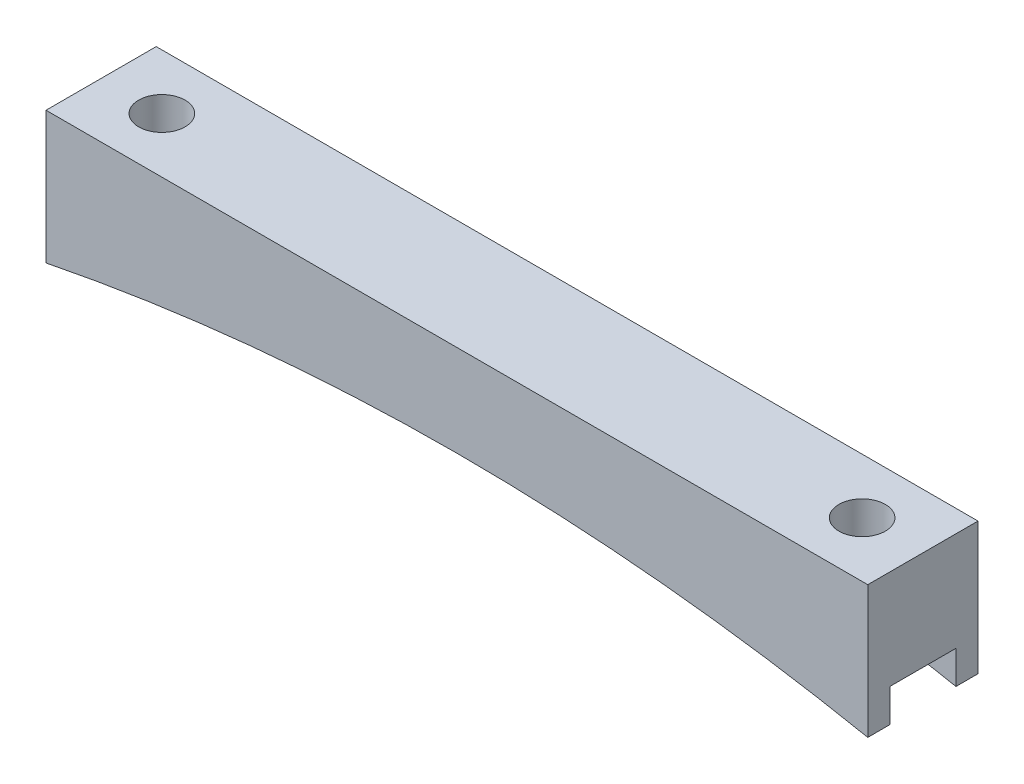
ISO-10303-21;
HEADER;
FILE_DESCRIPTION(('STEP AP214'),'2;1');
FILE_NAME('part.step','',(''),(''),'','','');
FILE_SCHEMA(('AUTOMOTIVE_DESIGN { 1 0 10303 214 1 1 1 1 }'));
ENDSEC;
DATA;
#1=APPLICATION_CONTEXT('core data for automotive mechanical design processes');
#2=APPLICATION_PROTOCOL_DEFINITION('international standard','automotive_design',2000,#1);
#3=PRODUCT_CONTEXT('',#1,'mechanical');
#4=PRODUCT('Part','Part','',(#3));
#5=PRODUCT_RELATED_PRODUCT_CATEGORY('part','',(#4));
#6=PRODUCT_DEFINITION_FORMATION('','',#4);
#7=PRODUCT_DEFINITION_CONTEXT('part definition',#1,'design');
#8=PRODUCT_DEFINITION('design','',#6,#7);
#9=PRODUCT_DEFINITION_SHAPE('','',#8);
#10=(LENGTH_UNIT() NAMED_UNIT(*) SI_UNIT(.MILLI.,.METRE.));
#11=(NAMED_UNIT(*) PLANE_ANGLE_UNIT() SI_UNIT($,.RADIAN.));
#12=(NAMED_UNIT(*) SI_UNIT($,.STERADIAN.) SOLID_ANGLE_UNIT());
#13=UNCERTAINTY_MEASURE_WITH_UNIT(LENGTH_MEASURE(1.E-05),#10,'distance_accuracy_value','');
#14=(GEOMETRIC_REPRESENTATION_CONTEXT(3) GLOBAL_UNCERTAINTY_ASSIGNED_CONTEXT((#13)) GLOBAL_UNIT_ASSIGNED_CONTEXT((#10,
#11,#12)) REPRESENTATION_CONTEXT('',''));
#15=CARTESIAN_POINT('',(0.,0.,0.));
#16=DIRECTION('',(0.,0.,1.));
#17=DIRECTION('',(1.,0.,0.));
#18=AXIS2_PLACEMENT_3D('',#15,#16,#17);
#19=CARTESIAN_POINT('',(47.34,0.,12.7));
#20=DIRECTION('',(-1.,0.,0.));
#21=DIRECTION('',(0.,-1.,0.));
#22=AXIS2_PLACEMENT_3D('',#19,#20,#21);
#23=PLANE('',#22);
#24=DIRECTION('',(0.,0.,-1.));
#25=VECTOR('',#24,1.);
#26=CARTESIAN_POINT('',(47.34,-15.24,12.7));
#27=LINE('',#26,#25);
#28=CARTESIAN_POINT('',(47.34,-15.24,12.7));
#29=VERTEX_POINT('',#28);
#30=CARTESIAN_POINT('',(47.34,-15.24,10.16));
#31=VERTEX_POINT('',#30);
#32=EDGE_CURVE('E156',#29,#31,#27,.T.);
#33=ORIENTED_EDGE('',*,*,#32,.T.);
#34=DIRECTION('',(0.,-1.,0.));
#35=VECTOR('',#34,1.);
#36=CARTESIAN_POINT('',(47.34,-15.24,10.16));
#37=LINE('',#36,#35);
#38=CARTESIAN_POINT('',(47.34,-11.43,10.16));
#39=VERTEX_POINT('',#38);
#40=EDGE_CURVE('E185',#39,#31,#37,.T.);
#41=ORIENTED_EDGE('',*,*,#40,.F.);
#42=DIRECTION('',(0.,0.,1.));
#43=VECTOR('',#42,1.);
#44=CARTESIAN_POINT('',(47.34,-11.43,10.16));
#45=LINE('',#44,#43);
#46=CARTESIAN_POINT('',(47.34,-11.43,2.54));
#47=VERTEX_POINT('',#46);
#48=EDGE_CURVE('E141',#47,#39,#45,.T.);
#49=ORIENTED_EDGE('',*,*,#48,.F.);
#50=DIRECTION('',(0.,1.,0.));
#51=VECTOR('',#50,1.);
#52=CARTESIAN_POINT('',(47.34,-15.24,2.54));
#53=LINE('',#52,#51);
#54=CARTESIAN_POINT('',(47.34,-15.24,2.54));
#55=VERTEX_POINT('',#54);
#56=EDGE_CURVE('E177',#55,#47,#53,.T.);
#57=ORIENTED_EDGE('',*,*,#56,.F.);
#58=CARTESIAN_POINT('',(47.34,-15.24,0.));
#59=VERTEX_POINT('',#58);
#60=EDGE_CURVE('E174',#55,#59,#27,.T.);
#61=ORIENTED_EDGE('',*,*,#60,.T.);
#62=DIRECTION('',(0.,1.,0.));
#63=VECTOR('',#62,1.);
#64=CARTESIAN_POINT('',(47.34,0.,0.));
#65=LINE('',#64,#63);
#66=CARTESIAN_POINT('',(47.34,0.,0.));
#67=VERTEX_POINT('',#66);
#68=EDGE_CURVE('E213',#59,#67,#65,.T.);
#69=ORIENTED_EDGE('',*,*,#68,.T.);
#70=DIRECTION('',(0.,0.,-1.));
#71=VECTOR('',#70,1.);
#72=CARTESIAN_POINT('',(47.34,0.,12.7));
#73=LINE('',#72,#71);
#74=CARTESIAN_POINT('',(47.34,0.,12.7));
#75=VERTEX_POINT('',#74);
#76=EDGE_CURVE('E154',#75,#67,#73,.T.);
#77=ORIENTED_EDGE('',*,*,#76,.F.);
#78=DIRECTION('',(0.,1.,0.));
#79=VECTOR('',#78,1.);
#80=CARTESIAN_POINT('',(47.34,0.,12.7));
#81=LINE('',#80,#79);
#82=EDGE_CURVE('E217',#29,#75,#81,.T.);
#83=ORIENTED_EDGE('',*,*,#82,.F.);
#84=EDGE_LOOP('',(#33,#41,#49,#57,#61,#69,#77,#83));
#85=FACE_BOUND('',#84,.T.);
#86=ADVANCED_FACE('F43',(#85),#23,.F.);
#87=CARTESIAN_POINT('',(-47.34,0.,12.7));
#88=DIRECTION('',(0.,-1.,0.));
#89=DIRECTION('',(1.,0.,0.));
#90=AXIS2_PLACEMENT_3D('',#87,#88,#89);
#91=PLANE('',#90);
#92=CARTESIAN_POINT('',(-40.34,0.,6.35));
#93=DIRECTION('',(0.,1.,0.));
#94=DIRECTION('',(-1.,0.,0.));
#95=AXIS2_PLACEMENT_3D('',#92,#93,#94);
#96=CIRCLE('',#95,2.675);
#97=CARTESIAN_POINT('',(-43.015,0.,6.35));
#98=VERTEX_POINT('',#97);
#99=EDGE_CURVE('E209',#98,#98,#96,.T.);
#100=ORIENTED_EDGE('',*,*,#99,.F.);
#101=EDGE_LOOP('',(#100));
#102=FACE_BOUND('',#101,.T.);
#103=CARTESIAN_POINT('',(40.34,0.,6.35));
#104=DIRECTION('',(0.,1.,0.));
#105=DIRECTION('',(-1.,0.,0.));
#106=AXIS2_PLACEMENT_3D('',#103,#104,#105);
#107=CIRCLE('',#106,2.675);
#108=CARTESIAN_POINT('',(37.665,0.,6.35));
#109=VERTEX_POINT('',#108);
#110=EDGE_CURVE('E208',#109,#109,#107,.T.);
#111=ORIENTED_EDGE('',*,*,#110,.F.);
#112=EDGE_LOOP('',(#111));
#113=FACE_BOUND('',#112,.T.);
#114=DIRECTION('',(-1.,0.,0.));
#115=VECTOR('',#114,1.);
#116=CARTESIAN_POINT('',(-47.34,0.,0.));
#117=LINE('',#116,#115);
#118=CARTESIAN_POINT('',(-47.34,0.,0.));
#119=VERTEX_POINT('',#118);
#120=EDGE_CURVE('E232',#67,#119,#117,.T.);
#121=ORIENTED_EDGE('',*,*,#120,.T.);
#122=DIRECTION('',(0.,0.,-1.));
#123=VECTOR('',#122,1.);
#124=CARTESIAN_POINT('',(-47.34,0.,12.7));
#125=LINE('',#124,#123);
#126=CARTESIAN_POINT('',(-47.34,0.,12.7));
#127=VERTEX_POINT('',#126);
#128=EDGE_CURVE('E148',#127,#119,#125,.T.);
#129=ORIENTED_EDGE('',*,*,#128,.F.);
#130=DIRECTION('',(-1.,0.,0.));
#131=VECTOR('',#130,1.);
#132=CARTESIAN_POINT('',(-47.34,0.,12.7));
#133=LINE('',#132,#131);
#134=EDGE_CURVE('E221',#75,#127,#133,.T.);
#135=ORIENTED_EDGE('',*,*,#134,.F.);
#136=ORIENTED_EDGE('',*,*,#76,.T.);
#137=EDGE_LOOP('',(#121,#129,#135,#136));
#138=FACE_BOUND('',#137,.T.);
#139=ADVANCED_FACE('F247',(#102,#113,#138),#91,.F.);
#140=CARTESIAN_POINT('',(-47.34,0.,12.7));
#141=DIRECTION('',(1.,0.,0.));
#142=DIRECTION('',(0.,1.,0.));
#143=AXIS2_PLACEMENT_3D('',#140,#141,#142);
#144=PLANE('',#143);
#145=DIRECTION('',(0.,0.,1.));
#146=VECTOR('',#145,1.);
#147=CARTESIAN_POINT('',(-47.34,-11.43,10.16));
#148=LINE('',#147,#146);
#149=CARTESIAN_POINT('',(-47.34,-11.43,2.54));
#150=VERTEX_POINT('',#149);
#151=CARTESIAN_POINT('',(-47.34,-11.43,10.16));
#152=VERTEX_POINT('',#151);
#153=EDGE_CURVE('E139',#150,#152,#148,.T.);
#154=ORIENTED_EDGE('',*,*,#153,.T.);
#155=DIRECTION('',(0.,-1.,0.));
#156=VECTOR('',#155,1.);
#157=CARTESIAN_POINT('',(-47.34,-15.24,10.16));
#158=LINE('',#157,#156);
#159=CARTESIAN_POINT('',(-47.34,-15.24,10.16));
#160=VERTEX_POINT('',#159);
#161=EDGE_CURVE('E124',#152,#160,#158,.T.);
#162=ORIENTED_EDGE('',*,*,#161,.T.);
#163=DIRECTION('',(0.,0.,-1.));
#164=VECTOR('',#163,1.);
#165=CARTESIAN_POINT('',(-47.34,-15.24,12.7));
#166=LINE('',#165,#164);
#167=CARTESIAN_POINT('',(-47.34,-15.24,12.7));
#168=VERTEX_POINT('',#167);
#169=EDGE_CURVE('E136',#168,#160,#166,.T.);
#170=ORIENTED_EDGE('',*,*,#169,.F.);
#171=DIRECTION('',(0.,-1.,0.));
#172=VECTOR('',#171,1.);
#173=CARTESIAN_POINT('',(-47.34,0.,12.7));
#174=LINE('',#173,#172);
#175=EDGE_CURVE('E225',#127,#168,#174,.T.);
#176=ORIENTED_EDGE('',*,*,#175,.F.);
#177=ORIENTED_EDGE('',*,*,#128,.T.);
#178=DIRECTION('',(0.,-1.,0.));
#179=VECTOR('',#178,1.);
#180=CARTESIAN_POINT('',(-47.34,0.,0.));
#181=LINE('',#180,#179);
#182=CARTESIAN_POINT('',(-47.34,-15.24,0.));
#183=VERTEX_POINT('',#182);
#184=EDGE_CURVE('E235',#119,#183,#181,.T.);
#185=ORIENTED_EDGE('',*,*,#184,.T.);
#186=CARTESIAN_POINT('',(-47.34,-15.24,2.54));
#187=VERTEX_POINT('',#186);
#188=EDGE_CURVE('E149',#187,#183,#166,.T.);
#189=ORIENTED_EDGE('',*,*,#188,.F.);
#190=DIRECTION('',(0.,1.,0.));
#191=VECTOR('',#190,1.);
#192=CARTESIAN_POINT('',(-47.34,-15.24,2.54));
#193=LINE('',#192,#191);
#194=EDGE_CURVE('E67',#187,#150,#193,.T.);
#195=ORIENTED_EDGE('',*,*,#194,.T.);
#196=EDGE_LOOP('',(#154,#162,#170,#176,#177,#185,#189,#195));
#197=FACE_BOUND('',#196,.T.);
#198=ADVANCED_FACE('F134',(#197),#144,.F.);
#199=CARTESIAN_POINT('',(0.,-251.850681077588,12.7));
#200=DIRECTION('',(0.,0.,-1.));
#201=DIRECTION('',(-1.,0.,0.));
#202=AXIS2_PLACEMENT_3D('',#199,#200,#201);
#203=CYLINDRICAL_SURFACE('',#202,241.3);
#204=DIRECTION('',(0.,0.,-1.));
#205=VECTOR('',#204,1.);
#206=CARTESIAN_POINT('',(20.5812076950983,-11.43,12.7));
#207=LINE('',#206,#205);
#208=CARTESIAN_POINT('',(20.5812076950983,-11.43,2.54));
#209=VERTEX_POINT('',#208);
#210=CARTESIAN_POINT('',(20.5812076950983,-11.43,10.16));
#211=VERTEX_POINT('',#210);
#212=EDGE_CURVE('E172',#209,#211,#207,.F.);
#213=ORIENTED_EDGE('',*,*,#212,.T.);
#214=CARTESIAN_POINT('',(0.,-251.850681077588,10.16));
#215=DIRECTION('',(0.,0.,1.));
#216=DIRECTION('',(1.,0.,0.));
#217=AXIS2_PLACEMENT_3D('',#214,#215,#216);
#218=CIRCLE('',#217,241.3);
#219=EDGE_CURVE('E11',#211,#31,#218,.F.);
#220=ORIENTED_EDGE('',*,*,#219,.T.);
#221=ORIENTED_EDGE('',*,*,#32,.F.);
#222=CARTESIAN_POINT('',(0.,-251.850681077588,12.7));
#223=DIRECTION('',(0.,0.,-1.));
#224=DIRECTION('',(-1.,0.,0.));
#225=AXIS2_PLACEMENT_3D('',#222,#223,#224);
#226=CIRCLE('',#225,241.3);
#227=EDGE_CURVE('E146',#168,#29,#226,.T.);
#228=ORIENTED_EDGE('',*,*,#227,.F.);
#229=ORIENTED_EDGE('',*,*,#169,.T.);
#230=CARTESIAN_POINT('',(-20.5812076950983,-11.43,10.16));
#231=VERTEX_POINT('',#230);
#232=EDGE_CURVE('E46',#160,#231,#218,.F.);
#233=ORIENTED_EDGE('',*,*,#232,.T.);
#234=DIRECTION('',(0.,0.,-1.));
#235=VECTOR('',#234,1.);
#236=CARTESIAN_POINT('',(-20.5812076950983,-11.43,12.7));
#237=LINE('',#236,#235);
#238=CARTESIAN_POINT('',(-20.5812076950983,-11.43,2.54));
#239=VERTEX_POINT('',#238);
#240=EDGE_CURVE('E203',#231,#239,#237,.T.);
#241=ORIENTED_EDGE('',*,*,#240,.T.);
#242=CARTESIAN_POINT('',(0.,-251.850681077588,2.54));
#243=DIRECTION('',(0.,0.,-1.));
#244=DIRECTION('',(-1.,0.,0.));
#245=AXIS2_PLACEMENT_3D('',#242,#243,#244);
#246=CIRCLE('',#245,241.3);
#247=EDGE_CURVE('E131',#239,#187,#246,.F.);
#248=ORIENTED_EDGE('',*,*,#247,.T.);
#249=ORIENTED_EDGE('',*,*,#188,.T.);
#250=CARTESIAN_POINT('',(0.,-251.850681077588,0.));
#251=DIRECTION('',(0.,0.,-1.));
#252=DIRECTION('',(-1.,0.,0.));
#253=AXIS2_PLACEMENT_3D('',#250,#251,#252);
#254=CIRCLE('',#253,241.3);
#255=EDGE_CURVE('E222',#183,#59,#254,.T.);
#256=ORIENTED_EDGE('',*,*,#255,.T.);
#257=ORIENTED_EDGE('',*,*,#60,.F.);
#258=EDGE_CURVE('E52',#55,#209,#246,.F.);
#259=ORIENTED_EDGE('',*,*,#258,.T.);
#260=EDGE_LOOP('',(#213,#220,#221,#228,#229,#233,#241,#248,#249,#256,#257,#259));
#261=FACE_BOUND('',#260,.T.);
#262=ADVANCED_FACE('F144',(#261),#203,.F.);
#263=CARTESIAN_POINT('',(0.,-251.850681077588,12.7));
#264=DIRECTION('',(0.,0.,-1.));
#265=DIRECTION('',(-1.,0.,0.));
#266=AXIS2_PLACEMENT_3D('',#263,#264,#265);
#267=PLANE('',#266);
#268=ORIENTED_EDGE('',*,*,#82,.T.);
#269=ORIENTED_EDGE('',*,*,#134,.T.);
#270=ORIENTED_EDGE('',*,*,#175,.T.);
#271=ORIENTED_EDGE('',*,*,#227,.T.);
#272=EDGE_LOOP('',(#268,#269,#270,#271));
#273=FACE_BOUND('',#272,.T.);
#274=ADVANCED_FACE('F250',(#273),#267,.F.);
#275=CARTESIAN_POINT('',(0.,-251.850681077588,0.));
#276=DIRECTION('',(0.,0.,-1.));
#277=DIRECTION('',(-1.,0.,0.));
#278=AXIS2_PLACEMENT_3D('',#275,#276,#277);
#279=PLANE('',#278);
#280=ORIENTED_EDGE('',*,*,#68,.F.);
#281=ORIENTED_EDGE('',*,*,#255,.F.);
#282=ORIENTED_EDGE('',*,*,#184,.F.);
#283=ORIENTED_EDGE('',*,*,#120,.F.);
#284=EDGE_LOOP('',(#280,#281,#282,#283));
#285=FACE_BOUND('',#284,.T.);
#286=ADVANCED_FACE('F243',(#285),#279,.T.);
#287=CARTESIAN_POINT('',(40.34,-15.24,6.35));
#288=DIRECTION('',(0.,1.,0.));
#289=DIRECTION('',(-1.,0.,0.));
#290=AXIS2_PLACEMENT_3D('',#287,#288,#289);
#291=CYLINDRICAL_SURFACE('',#290,2.675);
#292=CARTESIAN_POINT('',(40.34,-11.43,6.35));
#293=DIRECTION('',(0.,1.,0.));
#294=DIRECTION('',(0.,0.,1.));
#295=AXIS2_PLACEMENT_3D('',#292,#293,#294);
#296=CIRCLE('',#295,2.675);
#297=CARTESIAN_POINT('',(40.34,-11.43,9.025));
#298=VERTEX_POINT('',#297);
#299=EDGE_CURVE('E166',#298,#298,#296,.F.);
#300=ORIENTED_EDGE('',*,*,#299,.T.);
#301=EDGE_LOOP('',(#300));
#302=FACE_BOUND('',#301,.T.);
#303=ORIENTED_EDGE('',*,*,#110,.T.);
#304=EDGE_LOOP('',(#303));
#305=FACE_BOUND('',#304,.T.);
#306=ADVANCED_FACE('F292',(#302,#305),#291,.F.);
#307=CARTESIAN_POINT('',(-40.34,-15.24,6.35));
#308=DIRECTION('',(0.,1.,0.));
#309=DIRECTION('',(-1.,0.,0.));
#310=AXIS2_PLACEMENT_3D('',#307,#308,#309);
#311=CYLINDRICAL_SURFACE('',#310,2.675);
#312=CARTESIAN_POINT('',(-40.34,-11.43,6.35));
#313=DIRECTION('',(0.,1.,0.));
#314=DIRECTION('',(0.,0.,1.));
#315=AXIS2_PLACEMENT_3D('',#312,#313,#314);
#316=CIRCLE('',#315,2.675);
#317=CARTESIAN_POINT('',(-40.34,-11.43,9.025));
#318=VERTEX_POINT('',#317);
#319=EDGE_CURVE('E163',#318,#318,#316,.F.);
#320=ORIENTED_EDGE('',*,*,#319,.T.);
#321=EDGE_LOOP('',(#320));
#322=FACE_BOUND('',#321,.T.);
#323=ORIENTED_EDGE('',*,*,#99,.T.);
#324=EDGE_LOOP('',(#323));
#325=FACE_BOUND('',#324,.T.);
#326=ADVANCED_FACE('F274',(#322,#325),#311,.F.);
#327=CARTESIAN_POINT('',(-47.34,-11.43,10.16));
#328=DIRECTION('',(0.,1.,0.));
#329=DIRECTION('',(0.,0.,1.));
#330=AXIS2_PLACEMENT_3D('',#327,#328,#329);
#331=PLANE('',#330);
#332=ORIENTED_EDGE('',*,*,#319,.F.);
#333=EDGE_LOOP('',(#332));
#334=FACE_BOUND('',#333,.T.);
#335=DIRECTION('',(1.,0.,0.));
#336=VECTOR('',#335,1.);
#337=CARTESIAN_POINT('',(-47.34,-11.43,10.16));
#338=LINE('',#337,#336);
#339=EDGE_CURVE('E126',#152,#231,#338,.T.);
#340=ORIENTED_EDGE('',*,*,#339,.F.);
#341=ORIENTED_EDGE('',*,*,#153,.F.);
#342=DIRECTION('',(1.,0.,0.));
#343=VECTOR('',#342,1.);
#344=CARTESIAN_POINT('',(-47.34,-11.43,2.54));
#345=LINE('',#344,#343);
#346=EDGE_CURVE('E196',#150,#239,#345,.T.);
#347=ORIENTED_EDGE('',*,*,#346,.T.);
#348=ORIENTED_EDGE('',*,*,#240,.F.);
#349=EDGE_LOOP('',(#340,#341,#347,#348));
#350=FACE_BOUND('',#349,.T.);
#351=ADVANCED_FACE('F266',(#334,#350),#331,.F.);
#352=CARTESIAN_POINT('',(-47.34,-15.24,2.54));
#353=DIRECTION('',(0.,0.,-1.));
#354=DIRECTION('',(-1.,0.,0.));
#355=AXIS2_PLACEMENT_3D('',#352,#353,#354);
#356=PLANE('',#355);
#357=ORIENTED_EDGE('',*,*,#346,.F.);
#358=ORIENTED_EDGE('',*,*,#194,.F.);
#359=ORIENTED_EDGE('',*,*,#247,.F.);
#360=EDGE_LOOP('',(#357,#358,#359));
#361=FACE_BOUND('',#360,.T.);
#362=ADVANCED_FACE('F271',(#361),#356,.F.);
#363=CARTESIAN_POINT('',(-47.34,-15.24,10.16));
#364=DIRECTION('',(0.,0.,1.));
#365=DIRECTION('',(1.,0.,0.));
#366=AXIS2_PLACEMENT_3D('',#363,#364,#365);
#367=PLANE('',#366);
#368=ORIENTED_EDGE('',*,*,#161,.F.);
#369=ORIENTED_EDGE('',*,*,#339,.T.);
#370=ORIENTED_EDGE('',*,*,#232,.F.);
#371=EDGE_LOOP('',(#368,#369,#370));
#372=FACE_BOUND('',#371,.T.);
#373=ADVANCED_FACE('F123',(#372),#367,.F.);
#374=EDGE_CURVE('E195',#211,#39,#338,.T.);
#375=ORIENTED_EDGE('',*,*,#374,.T.);
#376=ORIENTED_EDGE('',*,*,#40,.T.);
#377=ORIENTED_EDGE('',*,*,#219,.F.);
#378=EDGE_LOOP('',(#375,#376,#377));
#379=FACE_BOUND('',#378,.T.);
#380=ADVANCED_FACE('F254',(#379),#367,.F.);
#381=ORIENTED_EDGE('',*,*,#56,.T.);
#382=EDGE_CURVE('E59',#209,#47,#345,.T.);
#383=ORIENTED_EDGE('',*,*,#382,.F.);
#384=ORIENTED_EDGE('',*,*,#258,.F.);
#385=EDGE_LOOP('',(#381,#383,#384));
#386=FACE_BOUND('',#385,.T.);
#387=ADVANCED_FACE('F176',(#386),#356,.F.);
#388=ORIENTED_EDGE('',*,*,#299,.F.);
#389=EDGE_LOOP('',(#388));
#390=FACE_BOUND('',#389,.T.);
#391=ORIENTED_EDGE('',*,*,#382,.T.);
#392=ORIENTED_EDGE('',*,*,#48,.T.);
#393=ORIENTED_EDGE('',*,*,#374,.F.);
#394=ORIENTED_EDGE('',*,*,#212,.F.);
#395=EDGE_LOOP('',(#391,#392,#393,#394));
#396=FACE_BOUND('',#395,.T.);
#397=ADVANCED_FACE('F258',(#390,#396),#331,.F.);
#398=CLOSED_SHELL('',(#86,#139,#198,#262,#274,#286,#306,#326,#351,#362,#373,#380,#387,#397));
#399=MANIFOLD_SOLID_BREP('B2',#398);
#400=ADVANCED_BREP_SHAPE_REPRESENTATION('',(#18,#399),#14);
#401=SHAPE_DEFINITION_REPRESENTATION(#9,#400);
ENDSEC;
END-ISO-10303-21;
